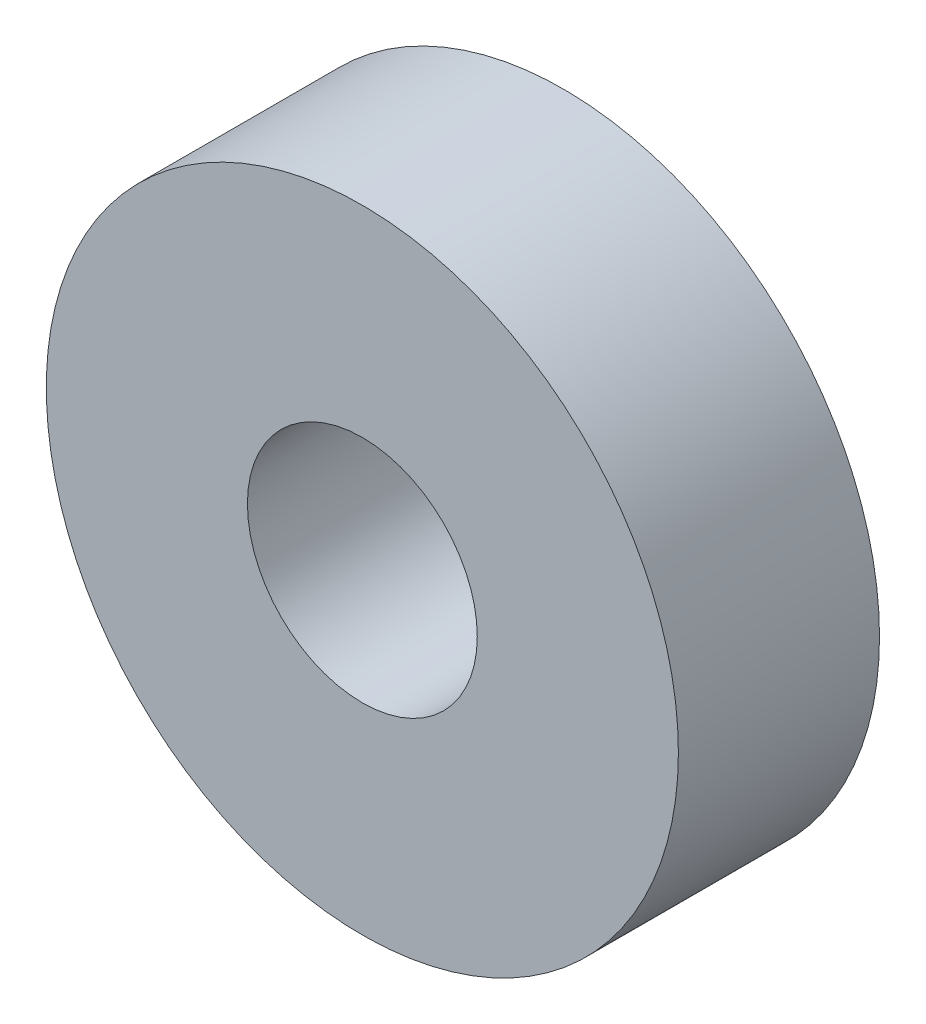
ISO-10303-21;
HEADER;
FILE_DESCRIPTION(('STEP AP214'),'2;1');
FILE_NAME('part.step','',(''),(''),'','','');
FILE_SCHEMA(('AUTOMOTIVE_DESIGN { 1 0 10303 214 1 1 1 1 }'));
ENDSEC;
DATA;
#1=APPLICATION_CONTEXT('core data for automotive mechanical design processes');
#2=APPLICATION_PROTOCOL_DEFINITION('international standard','automotive_design',2000,#1);
#3=PRODUCT_CONTEXT('',#1,'mechanical');
#4=PRODUCT('Part','Part','',(#3));
#5=PRODUCT_RELATED_PRODUCT_CATEGORY('part','',(#4));
#6=PRODUCT_DEFINITION_FORMATION('','',#4);
#7=PRODUCT_DEFINITION_CONTEXT('part definition',#1,'design');
#8=PRODUCT_DEFINITION('design','',#6,#7);
#9=PRODUCT_DEFINITION_SHAPE('','',#8);
#10=(LENGTH_UNIT() NAMED_UNIT(*) SI_UNIT(.MILLI.,.METRE.));
#11=(NAMED_UNIT(*) PLANE_ANGLE_UNIT() SI_UNIT($,.RADIAN.));
#12=(NAMED_UNIT(*) SI_UNIT($,.STERADIAN.) SOLID_ANGLE_UNIT());
#13=UNCERTAINTY_MEASURE_WITH_UNIT(LENGTH_MEASURE(1.E-05),#10,'distance_accuracy_value','');
#14=(GEOMETRIC_REPRESENTATION_CONTEXT(3) GLOBAL_UNCERTAINTY_ASSIGNED_CONTEXT((#13)) GLOBAL_UNIT_ASSIGNED_CONTEXT((#10,
#11,#12)) REPRESENTATION_CONTEXT('',''));
#15=CARTESIAN_POINT('',(0.,0.,0.));
#16=DIRECTION('',(0.,0.,1.));
#17=DIRECTION('',(1.,0.,0.));
#18=AXIS2_PLACEMENT_3D('',#15,#16,#17);
#19=CARTESIAN_POINT('',(0.,0.,5.5));
#20=DIRECTION('',(0.,0.,1.));
#21=DIRECTION('',(1.,0.,0.));
#22=AXIS2_PLACEMENT_3D('',#19,#20,#21);
#23=PLANE('',#22);
#24=CARTESIAN_POINT('',(0.,0.,5.5));
#25=DIRECTION('',(0.,0.,1.));
#26=DIRECTION('',(1.,0.,0.));
#27=AXIS2_PLACEMENT_3D('',#24,#25,#26);
#28=CIRCLE('',#27,6.28571428571429);
#29=CARTESIAN_POINT('',(6.28571428571429,0.,5.5));
#30=VERTEX_POINT('',#29);
#31=EDGE_CURVE('E10',#30,#30,#28,.T.);
#32=ORIENTED_EDGE('',*,*,#31,.T.);
#33=EDGE_LOOP('',(#32));
#34=FACE_BOUND('',#33,.T.);
#35=CARTESIAN_POINT('',(0.,0.,5.5));
#36=DIRECTION('',(0.,0.,1.));
#37=DIRECTION('',(1.,0.,0.));
#38=AXIS2_PLACEMENT_3D('',#35,#36,#37);
#39=CIRCLE('',#38,2.28571428571429);
#40=CARTESIAN_POINT('',(2.28571428571429,0.,5.5));
#41=VERTEX_POINT('',#40);
#42=EDGE_CURVE('E48',#41,#41,#39,.T.);
#43=ORIENTED_EDGE('',*,*,#42,.F.);
#44=EDGE_LOOP('',(#43));
#45=FACE_BOUND('',#44,.T.);
#46=ADVANCED_FACE('F37',(#34,#45),#23,.T.);
#47=CARTESIAN_POINT('',(0.,0.,1.5));
#48=DIRECTION('',(0.,0.,1.));
#49=DIRECTION('',(1.,0.,0.));
#50=AXIS2_PLACEMENT_3D('',#47,#48,#49);
#51=PLANE('',#50);
#52=CARTESIAN_POINT('',(0.,0.,1.5));
#53=DIRECTION('',(0.,0.,1.));
#54=DIRECTION('',(1.,0.,0.));
#55=AXIS2_PLACEMENT_3D('',#52,#53,#54);
#56=CIRCLE('',#55,6.28571428571429);
#57=CARTESIAN_POINT('',(6.28571428571429,0.,1.5));
#58=VERTEX_POINT('',#57);
#59=EDGE_CURVE('E41',#58,#58,#56,.T.);
#60=ORIENTED_EDGE('',*,*,#59,.F.);
#61=EDGE_LOOP('',(#60));
#62=FACE_BOUND('',#61,.T.);
#63=CARTESIAN_POINT('',(0.,0.,1.5));
#64=DIRECTION('',(0.,0.,1.));
#65=DIRECTION('',(1.,0.,0.));
#66=AXIS2_PLACEMENT_3D('',#63,#64,#65);
#67=CIRCLE('',#66,2.28571428571429);
#68=CARTESIAN_POINT('',(2.28571428571429,0.,1.5));
#69=VERTEX_POINT('',#68);
#70=EDGE_CURVE('E50',#69,#69,#67,.T.);
#71=ORIENTED_EDGE('',*,*,#70,.T.);
#72=EDGE_LOOP('',(#71));
#73=FACE_BOUND('',#72,.T.);
#74=ADVANCED_FACE('F60',(#62,#73),#51,.F.);
#75=CARTESIAN_POINT('',(0.,0.,5.5));
#76=DIRECTION('',(0.,0.,-1.));
#77=DIRECTION('',(-1.,0.,0.));
#78=AXIS2_PLACEMENT_3D('',#75,#76,#77);
#79=CYLINDRICAL_SURFACE('',#78,6.28571428571429);
#80=ORIENTED_EDGE('',*,*,#31,.F.);
#81=EDGE_LOOP('',(#80));
#82=FACE_BOUND('',#81,.T.);
#83=ORIENTED_EDGE('',*,*,#59,.T.);
#84=EDGE_LOOP('',(#83));
#85=FACE_BOUND('',#84,.T.);
#86=ADVANCED_FACE('F39',(#82,#85),#79,.T.);
#87=CARTESIAN_POINT('',(0.,0.,5.5));
#88=DIRECTION('',(0.,0.,-1.));
#89=DIRECTION('',(-1.,0.,0.));
#90=AXIS2_PLACEMENT_3D('',#87,#88,#89);
#91=CYLINDRICAL_SURFACE('',#90,2.28571428571429);
#92=ORIENTED_EDGE('',*,*,#42,.T.);
#93=EDGE_LOOP('',(#92));
#94=FACE_BOUND('',#93,.T.);
#95=ORIENTED_EDGE('',*,*,#70,.F.);
#96=EDGE_LOOP('',(#95));
#97=FACE_BOUND('',#96,.T.);
#98=ADVANCED_FACE('F56',(#94,#97),#91,.F.);
#99=CLOSED_SHELL('',(#46,#74,#86,#98));
#100=MANIFOLD_SOLID_BREP('B2',#99);
#101=ADVANCED_BREP_SHAPE_REPRESENTATION('',(#18,#100),#14);
#102=SHAPE_DEFINITION_REPRESENTATION(#9,#101);
ENDSEC;
END-ISO-10303-21;
